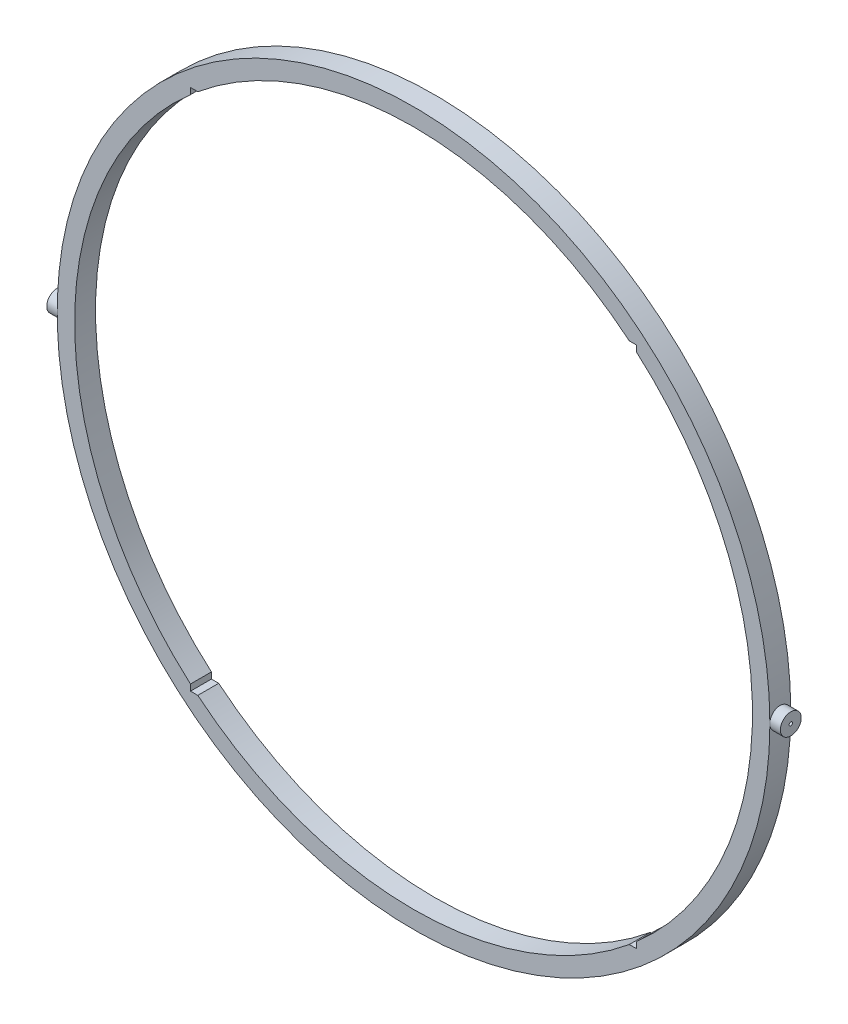
ISO-10303-21;
HEADER;
FILE_DESCRIPTION(('STEP AP214'),'2;1');
FILE_NAME('part.step','',(''),(''),'','','');
FILE_SCHEMA(('AUTOMOTIVE_DESIGN { 1 0 10303 214 1 1 1 1 }'));
ENDSEC;
DATA;
#1=APPLICATION_CONTEXT('core data for automotive mechanical design processes');
#2=APPLICATION_PROTOCOL_DEFINITION('international standard','automotive_design',2000,#1);
#3=PRODUCT_CONTEXT('',#1,'mechanical');
#4=PRODUCT('Part','Part','',(#3));
#5=PRODUCT_RELATED_PRODUCT_CATEGORY('part','',(#4));
#6=PRODUCT_DEFINITION_FORMATION('','',#4);
#7=PRODUCT_DEFINITION_CONTEXT('part definition',#1,'design');
#8=PRODUCT_DEFINITION('design','',#6,#7);
#9=PRODUCT_DEFINITION_SHAPE('','',#8);
#10=(LENGTH_UNIT() NAMED_UNIT(*) SI_UNIT(.MILLI.,.METRE.));
#11=(NAMED_UNIT(*) PLANE_ANGLE_UNIT() SI_UNIT($,.RADIAN.));
#12=(NAMED_UNIT(*) SI_UNIT($,.STERADIAN.) SOLID_ANGLE_UNIT());
#13=UNCERTAINTY_MEASURE_WITH_UNIT(LENGTH_MEASURE(1.E-05),#10,'distance_accuracy_value','');
#14=(GEOMETRIC_REPRESENTATION_CONTEXT(3) GLOBAL_UNCERTAINTY_ASSIGNED_CONTEXT((#13)) GLOBAL_UNIT_ASSIGNED_CONTEXT((#10,
#11,#12)) REPRESENTATION_CONTEXT('',''));
#15=CARTESIAN_POINT('',(0.,0.,0.));
#16=DIRECTION('',(0.,0.,1.));
#17=DIRECTION('',(1.,0.,0.));
#18=AXIS2_PLACEMENT_3D('',#15,#16,#17);
#19=CARTESIAN_POINT('',(105.24716621,0.,3.));
#20=DIRECTION('',(-1.,0.,0.));
#21=DIRECTION('',(0.,0.,1.));
#22=AXIS2_PLACEMENT_3D('',#19,#20,#21);
#23=CYLINDRICAL_SURFACE('',#22,3.);
#24=CARTESIAN_POINT('',(105.24716621,0.,3.));
#25=DIRECTION('',(-1.,0.,0.));
#26=DIRECTION('',(0.,0.,1.));
#27=AXIS2_PLACEMENT_3D('',#24,#25,#26);
#28=CIRCLE('',#27,3.);
#29=CARTESIAN_POINT('',(105.24716621,0.,6.));
#30=VERTEX_POINT('',#29);
#31=EDGE_CURVE('E11',#30,#30,#28,.T.);
#32=ORIENTED_EDGE('',*,*,#31,.T.);
#33=EDGE_LOOP('',(#32));
#34=FACE_BOUND('',#33,.T.);
#35=CARTESIAN_POINT('',(97.24716621,0.,3.));
#36=DIRECTION('',(-1.,0.,0.));
#37=DIRECTION('',(0.,0.,1.));
#38=AXIS2_PLACEMENT_3D('',#35,#36,#37);
#39=CIRCLE('',#38,3.);
#40=CARTESIAN_POINT('',(97.24716621,0.,6.));
#41=VERTEX_POINT('',#40);
#42=EDGE_CURVE('E49',#41,#41,#39,.T.);
#43=ORIENTED_EDGE('',*,*,#42,.F.);
#44=EDGE_LOOP('',(#43));
#45=FACE_BOUND('',#44,.T.);
#46=ADVANCED_FACE('F46',(#34,#45),#23,.T.);
#47=CARTESIAN_POINT('',(105.24716621,0.,3.));
#48=DIRECTION('',(-1.,0.,0.));
#49=DIRECTION('',(0.,0.,1.));
#50=AXIS2_PLACEMENT_3D('',#47,#48,#49);
#51=PLANE('',#50);
#52=CARTESIAN_POINT('',(105.24716621,0.,3.));
#53=DIRECTION('',(-1.,0.,0.));
#54=DIRECTION('',(0.,0.,1.));
#55=AXIS2_PLACEMENT_3D('',#52,#53,#54);
#56=CIRCLE('',#55,0.5);
#57=CARTESIAN_POINT('',(105.24716621,0.,3.5));
#58=VERTEX_POINT('',#57);
#59=EDGE_CURVE('E56',#58,#58,#56,.T.);
#60=ORIENTED_EDGE('',*,*,#59,.T.);
#61=EDGE_LOOP('',(#60));
#62=FACE_BOUND('',#61,.T.);
#63=ORIENTED_EDGE('',*,*,#31,.F.);
#64=EDGE_LOOP('',(#63));
#65=FACE_BOUND('',#64,.T.);
#66=ADVANCED_FACE('F64',(#62,#65),#51,.F.);
#67=CARTESIAN_POINT('',(97.24716621,0.,3.));
#68=DIRECTION('',(-1.,0.,0.));
#69=DIRECTION('',(0.,0.,1.));
#70=AXIS2_PLACEMENT_3D('',#67,#68,#69);
#71=PLANE('',#70);
#72=CARTESIAN_POINT('',(97.24716621,0.,3.));
#73=DIRECTION('',(-1.,0.,0.));
#74=DIRECTION('',(0.,0.,1.));
#75=AXIS2_PLACEMENT_3D('',#72,#73,#74);
#76=CIRCLE('',#75,0.5);
#77=CARTESIAN_POINT('',(97.24716621,0.,3.5));
#78=VERTEX_POINT('',#77);
#79=EDGE_CURVE('E58',#78,#78,#76,.T.);
#80=ORIENTED_EDGE('',*,*,#79,.F.);
#81=EDGE_LOOP('',(#80));
#82=FACE_BOUND('',#81,.T.);
#83=ORIENTED_EDGE('',*,*,#42,.T.);
#84=EDGE_LOOP('',(#83));
#85=FACE_BOUND('',#84,.T.);
#86=ADVANCED_FACE('F70',(#82,#85),#71,.T.);
#87=CARTESIAN_POINT('',(105.24716621,0.,3.));
#88=DIRECTION('',(-1.,0.,0.));
#89=DIRECTION('',(0.,0.,1.));
#90=AXIS2_PLACEMENT_3D('',#87,#88,#89);
#91=CYLINDRICAL_SURFACE('',#90,0.5);
#92=ORIENTED_EDGE('',*,*,#59,.F.);
#93=EDGE_LOOP('',(#92));
#94=FACE_BOUND('',#93,.T.);
#95=ORIENTED_EDGE('',*,*,#79,.T.);
#96=EDGE_LOOP('',(#95));
#97=FACE_BOUND('',#96,.T.);
#98=ADVANCED_FACE('F67',(#94,#97),#91,.F.);
#99=CLOSED_SHELL('',(#46,#66,#86,#98));
#100=MANIFOLD_SOLID_BREP('B2',#99);
#101=CARTESIAN_POINT('',(-105.24716621,0.,3.));
#102=DIRECTION('',(1.,0.,0.));
#103=DIRECTION('',(0.,0.,-1.));
#104=AXIS2_PLACEMENT_3D('',#101,#102,#103);
#105=CYLINDRICAL_SURFACE('',#104,3.);
#106=CARTESIAN_POINT('',(-105.24716621,0.,3.));
#107=DIRECTION('',(1.,0.,0.));
#108=DIRECTION('',(0.,0.,-1.));
#109=AXIS2_PLACEMENT_3D('',#106,#107,#108);
#110=CIRCLE('',#109,3.);
#111=CARTESIAN_POINT('',(-105.24716621,0.,0.));
#112=VERTEX_POINT('',#111);
#113=EDGE_CURVE('E45',#112,#112,#110,.T.);
#114=ORIENTED_EDGE('',*,*,#113,.T.);
#115=EDGE_LOOP('',(#114));
#116=FACE_BOUND('',#115,.T.);
#117=CARTESIAN_POINT('',(-97.24716621,0.,3.));
#118=DIRECTION('',(1.,0.,0.));
#119=DIRECTION('',(0.,0.,-1.));
#120=AXIS2_PLACEMENT_3D('',#117,#118,#119);
#121=CIRCLE('',#120,3.);
#122=CARTESIAN_POINT('',(-97.24716621,0.,0.));
#123=VERTEX_POINT('',#122);
#124=EDGE_CURVE('E120',#123,#123,#121,.T.);
#125=ORIENTED_EDGE('',*,*,#124,.F.);
#126=EDGE_LOOP('',(#125));
#127=FACE_BOUND('',#126,.T.);
#128=ADVANCED_FACE('F117',(#116,#127),#105,.T.);
#129=CARTESIAN_POINT('',(-105.24716621,0.,3.));
#130=DIRECTION('',(1.,0.,0.));
#131=DIRECTION('',(0.,0.,-1.));
#132=AXIS2_PLACEMENT_3D('',#129,#130,#131);
#133=PLANE('',#132);
#134=CARTESIAN_POINT('',(-105.24716621,0.,3.));
#135=DIRECTION('',(1.,0.,0.));
#136=DIRECTION('',(0.,0.,-1.));
#137=AXIS2_PLACEMENT_3D('',#134,#135,#136);
#138=CIRCLE('',#137,0.5);
#139=CARTESIAN_POINT('',(-105.24716621,0.,2.5));
#140=VERTEX_POINT('',#139);
#141=EDGE_CURVE('E127',#140,#140,#138,.T.);
#142=ORIENTED_EDGE('',*,*,#141,.T.);
#143=EDGE_LOOP('',(#142));
#144=FACE_BOUND('',#143,.T.);
#145=ORIENTED_EDGE('',*,*,#113,.F.);
#146=EDGE_LOOP('',(#145));
#147=FACE_BOUND('',#146,.T.);
#148=ADVANCED_FACE('F135',(#144,#147),#133,.F.);
#149=CARTESIAN_POINT('',(-97.24716621,0.,3.));
#150=DIRECTION('',(1.,0.,0.));
#151=DIRECTION('',(0.,0.,-1.));
#152=AXIS2_PLACEMENT_3D('',#149,#150,#151);
#153=PLANE('',#152);
#154=CARTESIAN_POINT('',(-97.24716621,0.,3.));
#155=DIRECTION('',(1.,0.,0.));
#156=DIRECTION('',(0.,0.,-1.));
#157=AXIS2_PLACEMENT_3D('',#154,#155,#156);
#158=CIRCLE('',#157,0.5);
#159=CARTESIAN_POINT('',(-97.24716621,0.,2.5));
#160=VERTEX_POINT('',#159);
#161=EDGE_CURVE('E129',#160,#160,#158,.T.);
#162=ORIENTED_EDGE('',*,*,#161,.F.);
#163=EDGE_LOOP('',(#162));
#164=FACE_BOUND('',#163,.T.);
#165=ORIENTED_EDGE('',*,*,#124,.T.);
#166=EDGE_LOOP('',(#165));
#167=FACE_BOUND('',#166,.T.);
#168=ADVANCED_FACE('F141',(#164,#167),#153,.T.);
#169=CARTESIAN_POINT('',(-105.24716621,0.,3.));
#170=DIRECTION('',(1.,0.,0.));
#171=DIRECTION('',(0.,0.,-1.));
#172=AXIS2_PLACEMENT_3D('',#169,#170,#171);
#173=CYLINDRICAL_SURFACE('',#172,0.5);
#174=ORIENTED_EDGE('',*,*,#141,.F.);
#175=EDGE_LOOP('',(#174));
#176=FACE_BOUND('',#175,.T.);
#177=ORIENTED_EDGE('',*,*,#161,.T.);
#178=EDGE_LOOP('',(#177));
#179=FACE_BOUND('',#178,.T.);
#180=ADVANCED_FACE('F138',(#176,#179),#173,.F.);
#181=CLOSED_SHELL('',(#128,#148,#168,#180));
#182=MANIFOLD_SOLID_BREP('B6',#181);
#183=CARTESIAN_POINT('',(0.,0.,6.));
#184=DIRECTION('',(0.,0.,-1.));
#185=DIRECTION('',(-1.,0.,0.));
#186=AXIS2_PLACEMENT_3D('',#183,#184,#185);
#187=CYLINDRICAL_SURFACE('',#186,97.24716621);
#188=DIRECTION('',(0.,0.,-1.));
#189=VECTOR('',#188,1.);
#190=CARTESIAN_POINT('',(-64.0000000000005,-73.2189274428088,6.));
#191=LINE('',#190,#189);
#192=CARTESIAN_POINT('',(-64.,-73.2189274428092,0.));
#193=VERTEX_POINT('',#192);
#194=CARTESIAN_POINT('',(-64.,-73.2189274428092,6.));
#195=VERTEX_POINT('',#194);
#196=EDGE_CURVE('E115',#193,#195,#191,.F.);
#197=ORIENTED_EDGE('',*,*,#196,.F.);
#198=CARTESIAN_POINT('',(0.,0.,0.));
#199=DIRECTION('',(0.,0.,1.));
#200=DIRECTION('',(1.,0.,0.));
#201=AXIS2_PLACEMENT_3D('',#198,#199,#200);
#202=CIRCLE('',#201,97.24716621);
#203=CARTESIAN_POINT('',(-64.,73.2189274428092,0.));
#204=VERTEX_POINT('',#203);
#205=EDGE_CURVE('E373',#204,#193,#202,.T.);
#206=ORIENTED_EDGE('',*,*,#205,.F.);
#207=DIRECTION('',(0.,0.,-1.));
#208=VECTOR('',#207,1.);
#209=CARTESIAN_POINT('',(-64.,73.2189274428092,6.));
#210=LINE('',#209,#208);
#211=CARTESIAN_POINT('',(-64.,73.2189274428092,6.));
#212=VERTEX_POINT('',#211);
#213=EDGE_CURVE('E351',#212,#204,#210,.T.);
#214=ORIENTED_EDGE('',*,*,#213,.F.);
#215=CARTESIAN_POINT('',(0.,0.,6.));
#216=DIRECTION('',(0.,0.,1.));
#217=DIRECTION('',(1.,0.,0.));
#218=AXIS2_PLACEMENT_3D('',#215,#216,#217);
#219=CIRCLE('',#218,97.24716621);
#220=EDGE_CURVE('E383',#212,#195,#219,.T.);
#221=ORIENTED_EDGE('',*,*,#220,.T.);
#222=EDGE_LOOP('',(#197,#206,#214,#221));
#223=FACE_BOUND('',#222,.T.);
#224=ADVANCED_FACE('F179',(#223),#187,.F.);
#225=DIRECTION('',(0.,0.,-1.));
#226=VECTOR('',#225,1.);
#227=CARTESIAN_POINT('',(64.0000000000011,-73.2189274428083,6.));
#228=LINE('',#227,#226);
#229=CARTESIAN_POINT('',(64.,-73.2189274428092,6.));
#230=VERTEX_POINT('',#229);
#231=CARTESIAN_POINT('',(64.,-73.2189274428092,0.));
#232=VERTEX_POINT('',#231);
#233=EDGE_CURVE('E358',#230,#232,#228,.T.);
#234=ORIENTED_EDGE('',*,*,#233,.F.);
#235=CARTESIAN_POINT('',(64.,73.2189274428092,6.));
#236=VERTEX_POINT('',#235);
#237=EDGE_CURVE('E336',#230,#236,#219,.T.);
#238=ORIENTED_EDGE('',*,*,#237,.T.);
#239=DIRECTION('',(0.,0.,-1.));
#240=VECTOR('',#239,1.);
#241=CARTESIAN_POINT('',(64.0000000000011,73.2189274428083,6.));
#242=LINE('',#241,#240);
#243=CARTESIAN_POINT('',(64.,73.2189274428092,0.));
#244=VERTEX_POINT('',#243);
#245=EDGE_CURVE('E284',#244,#236,#242,.F.);
#246=ORIENTED_EDGE('',*,*,#245,.F.);
#247=EDGE_CURVE('E335',#232,#244,#202,.T.);
#248=ORIENTED_EDGE('',*,*,#247,.F.);
#249=EDGE_LOOP('',(#234,#238,#246,#248));
#250=FACE_BOUND('',#249,.T.);
#251=ADVANCED_FACE('F398',(#250),#187,.F.);
#252=DIRECTION('',(0.,0.,-1.));
#253=VECTOR('',#252,1.);
#254=CARTESIAN_POINT('',(-61.9032417234782,-75.,6.));
#255=LINE('',#254,#253);
#256=CARTESIAN_POINT('',(-61.9032417234789,-74.9999999999994,6.));
#257=VERTEX_POINT('',#256);
#258=CARTESIAN_POINT('',(-61.9032417234781,-75.,0.));
#259=VERTEX_POINT('',#258);
#260=EDGE_CURVE('E187',#257,#259,#255,.T.);
#261=ORIENTED_EDGE('',*,*,#260,.F.);
#262=CARTESIAN_POINT('',(61.9032417234781,-75.,6.));
#263=VERTEX_POINT('',#262);
#264=EDGE_CURVE('E338',#257,#263,#219,.T.);
#265=ORIENTED_EDGE('',*,*,#264,.T.);
#266=DIRECTION('',(0.,0.,-1.));
#267=VECTOR('',#266,1.);
#268=CARTESIAN_POINT('',(61.9032417234785,-74.9999999999997,6.));
#269=LINE('',#268,#267);
#270=CARTESIAN_POINT('',(61.9032417234785,-74.9999999999997,0.));
#271=VERTEX_POINT('',#270);
#272=EDGE_CURVE('E356',#271,#263,#269,.F.);
#273=ORIENTED_EDGE('',*,*,#272,.F.);
#274=EDGE_CURVE('E342',#259,#271,#202,.T.);
#275=ORIENTED_EDGE('',*,*,#274,.F.);
#276=EDGE_LOOP('',(#261,#265,#273,#275));
#277=FACE_BOUND('',#276,.T.);
#278=ADVANCED_FACE('F372',(#277),#187,.F.);
#279=CARTESIAN_POINT('',(0.,0.,6.));
#280=DIRECTION('',(0.,0.,1.));
#281=DIRECTION('',(1.,0.,0.));
#282=AXIS2_PLACEMENT_3D('',#279,#280,#281);
#283=PLANE('',#282);
#284=DIRECTION('',(0.,-1.,0.));
#285=VECTOR('',#284,1.);
#286=CARTESIAN_POINT('',(-64.,-73.2189274428092,6.));
#287=LINE('',#286,#285);
#288=CARTESIAN_POINT('',(-64.,-75.,6.));
#289=VERTEX_POINT('',#288);
#290=EDGE_CURVE('E306',#195,#289,#287,.T.);
#291=ORIENTED_EDGE('',*,*,#290,.F.);
#292=ORIENTED_EDGE('',*,*,#220,.F.);
#293=DIRECTION('',(0.,-1.,0.));
#294=VECTOR('',#293,1.);
#295=CARTESIAN_POINT('',(-64.,73.2189274428092,6.));
#296=LINE('',#295,#294);
#297=CARTESIAN_POINT('',(-64.,75.,6.));
#298=VERTEX_POINT('',#297);
#299=EDGE_CURVE('E314',#298,#212,#296,.T.);
#300=ORIENTED_EDGE('',*,*,#299,.F.);
#301=DIRECTION('',(-1.,0.,0.));
#302=VECTOR('',#301,1.);
#303=CARTESIAN_POINT('',(-64.,75.,6.));
#304=LINE('',#303,#302);
#305=CARTESIAN_POINT('',(-61.9032417234781,75.,6.));
#306=VERTEX_POINT('',#305);
#307=EDGE_CURVE('E278',#306,#298,#304,.T.);
#308=ORIENTED_EDGE('',*,*,#307,.F.);
#309=CARTESIAN_POINT('',(61.9032417234785,74.9999999999997,6.));
#310=VERTEX_POINT('',#309);
#311=EDGE_CURVE('E296',#310,#306,#219,.T.);
#312=ORIENTED_EDGE('',*,*,#311,.F.);
#313=DIRECTION('',(-1.,0.,0.));
#314=VECTOR('',#313,1.);
#315=CARTESIAN_POINT('',(64.,75.,6.));
#316=LINE('',#315,#314);
#317=CARTESIAN_POINT('',(64.,75.,6.));
#318=VERTEX_POINT('',#317);
#319=EDGE_CURVE('E272',#318,#310,#316,.T.);
#320=ORIENTED_EDGE('',*,*,#319,.F.);
#321=DIRECTION('',(0.,1.,0.));
#322=VECTOR('',#321,1.);
#323=CARTESIAN_POINT('',(64.,73.2189274428092,6.));
#324=LINE('',#323,#322);
#325=EDGE_CURVE('E281',#236,#318,#324,.T.);
#326=ORIENTED_EDGE('',*,*,#325,.F.);
#327=ORIENTED_EDGE('',*,*,#237,.F.);
#328=DIRECTION('',(0.,1.,0.));
#329=VECTOR('',#328,1.);
#330=CARTESIAN_POINT('',(64.,-73.2189274428092,6.));
#331=LINE('',#330,#329);
#332=CARTESIAN_POINT('',(64.,-75.,6.));
#333=VERTEX_POINT('',#332);
#334=EDGE_CURVE('E299',#333,#230,#331,.T.);
#335=ORIENTED_EDGE('',*,*,#334,.F.);
#336=DIRECTION('',(1.,0.,0.));
#337=VECTOR('',#336,1.);
#338=CARTESIAN_POINT('',(64.,-75.,6.));
#339=LINE('',#338,#337);
#340=EDGE_CURVE('E301',#263,#333,#339,.T.);
#341=ORIENTED_EDGE('',*,*,#340,.F.);
#342=ORIENTED_EDGE('',*,*,#264,.F.);
#343=DIRECTION('',(1.,0.,0.));
#344=VECTOR('',#343,1.);
#345=CARTESIAN_POINT('',(-64.,-75.,6.));
#346=LINE('',#345,#344);
#347=EDGE_CURVE('E309',#289,#257,#346,.T.);
#348=ORIENTED_EDGE('',*,*,#347,.F.);
#349=EDGE_LOOP('',(#291,#292,#300,#308,#312,#320,#326,#327,#335,#341,#342,#348));
#350=FACE_BOUND('',#349,.T.);
#351=CARTESIAN_POINT('',(0.,0.,6.));
#352=DIRECTION('',(0.,0.,1.));
#353=DIRECTION('',(1.,0.,0.));
#354=AXIS2_PLACEMENT_3D('',#351,#352,#353);
#355=CIRCLE('',#354,102.24716621);
#356=CARTESIAN_POINT('',(102.24716621,0.,6.));
#357=VERTEX_POINT('',#356);
#358=EDGE_CURVE('E343',#357,#357,#355,.T.);
#359=ORIENTED_EDGE('',*,*,#358,.T.);
#360=EDGE_LOOP('',(#359));
#361=FACE_BOUND('',#360,.T.);
#362=ADVANCED_FACE('F292',(#350,#361),#283,.T.);
#363=CARTESIAN_POINT('',(0.,0.,0.));
#364=DIRECTION('',(0.,0.,1.));
#365=DIRECTION('',(1.,0.,0.));
#366=AXIS2_PLACEMENT_3D('',#363,#364,#365);
#367=PLANE('',#366);
#368=CARTESIAN_POINT('',(0.,0.,0.));
#369=DIRECTION('',(0.,0.,1.));
#370=DIRECTION('',(1.,0.,0.));
#371=AXIS2_PLACEMENT_3D('',#368,#369,#370);
#372=CIRCLE('',#371,102.24716621);
#373=CARTESIAN_POINT('',(102.24716621,0.,0.));
#374=VERTEX_POINT('',#373);
#375=EDGE_CURVE('E347',#374,#374,#372,.T.);
#376=ORIENTED_EDGE('',*,*,#375,.F.);
#377=EDGE_LOOP('',(#376));
#378=FACE_BOUND('',#377,.T.);
#379=ORIENTED_EDGE('',*,*,#205,.T.);
#380=DIRECTION('',(0.,-1.,0.));
#381=VECTOR('',#380,1.);
#382=CARTESIAN_POINT('',(-64.,0.,0.));
#383=LINE('',#382,#381);
#384=CARTESIAN_POINT('',(-64.,-75.,0.));
#385=VERTEX_POINT('',#384);
#386=EDGE_CURVE('E332',#193,#385,#383,.T.);
#387=ORIENTED_EDGE('',*,*,#386,.T.);
#388=DIRECTION('',(1.,0.,0.));
#389=VECTOR('',#388,1.);
#390=CARTESIAN_POINT('',(-9.92803125892652E-13,-75.0000000000008,0.));
#391=LINE('',#390,#389);
#392=EDGE_CURVE('E329',#385,#259,#391,.T.);
#393=ORIENTED_EDGE('',*,*,#392,.T.);
#394=ORIENTED_EDGE('',*,*,#274,.T.);
#395=DIRECTION('',(1.,0.,0.));
#396=VECTOR('',#395,1.);
#397=CARTESIAN_POINT('',(1.98560625178533E-12,-75.0000000000017,0.));
#398=LINE('',#397,#396);
#399=CARTESIAN_POINT('',(64.,-75.,0.));
#400=VERTEX_POINT('',#399);
#401=EDGE_CURVE('E194',#271,#400,#398,.T.);
#402=ORIENTED_EDGE('',*,*,#401,.T.);
#403=DIRECTION('',(0.,1.,0.));
#404=VECTOR('',#403,1.);
#405=CARTESIAN_POINT('',(64.,0.,0.));
#406=LINE('',#405,#404);
#407=EDGE_CURVE('E326',#400,#232,#406,.T.);
#408=ORIENTED_EDGE('',*,*,#407,.T.);
#409=ORIENTED_EDGE('',*,*,#247,.T.);
#410=DIRECTION('',(0.,1.,0.));
#411=VECTOR('',#410,1.);
#412=CARTESIAN_POINT('',(64.,0.,0.));
#413=LINE('',#412,#411);
#414=CARTESIAN_POINT('',(64.,75.,0.));
#415=VERTEX_POINT('',#414);
#416=EDGE_CURVE('E323',#244,#415,#413,.T.);
#417=ORIENTED_EDGE('',*,*,#416,.T.);
#418=DIRECTION('',(-1.,0.,0.));
#419=VECTOR('',#418,1.);
#420=CARTESIAN_POINT('',(1.98560625178533E-12,75.0000000000017,0.));
#421=LINE('',#420,#419);
#422=CARTESIAN_POINT('',(61.9032417234781,75.,0.));
#423=VERTEX_POINT('',#422);
#424=EDGE_CURVE('E275',#415,#423,#421,.T.);
#425=ORIENTED_EDGE('',*,*,#424,.T.);
#426=CARTESIAN_POINT('',(-61.9032417234782,75.,0.));
#427=VERTEX_POINT('',#426);
#428=EDGE_CURVE('E339',#423,#427,#202,.T.);
#429=ORIENTED_EDGE('',*,*,#428,.T.);
#430=DIRECTION('',(-1.,0.,0.));
#431=VECTOR('',#430,1.);
#432=CARTESIAN_POINT('',(-9.92803125892652E-13,75.0000000000008,0.));
#433=LINE('',#432,#431);
#434=CARTESIAN_POINT('',(-64.,75.,0.));
#435=VERTEX_POINT('',#434);
#436=EDGE_CURVE('E202',#427,#435,#433,.T.);
#437=ORIENTED_EDGE('',*,*,#436,.T.);
#438=DIRECTION('',(0.,-1.,0.));
#439=VECTOR('',#438,1.);
#440=CARTESIAN_POINT('',(-64.,0.,0.));
#441=LINE('',#440,#439);
#442=EDGE_CURVE('E319',#435,#204,#441,.T.);
#443=ORIENTED_EDGE('',*,*,#442,.T.);
#444=EDGE_LOOP('',(#379,#387,#393,#394,#402,#408,#409,#417,#425,#429,#437,#443));
#445=FACE_BOUND('',#444,.T.);
#446=ADVANCED_FACE('F371',(#378,#445),#367,.F.);
#447=CARTESIAN_POINT('',(0.,0.,6.));
#448=DIRECTION('',(0.,0.,-1.));
#449=DIRECTION('',(-1.,0.,0.));
#450=AXIS2_PLACEMENT_3D('',#447,#448,#449);
#451=CYLINDRICAL_SURFACE('',#450,102.24716621);
#452=ORIENTED_EDGE('',*,*,#358,.F.);
#453=EDGE_LOOP('',(#452));
#454=FACE_BOUND('',#453,.T.);
#455=ORIENTED_EDGE('',*,*,#375,.T.);
#456=EDGE_LOOP('',(#455));
#457=FACE_BOUND('',#456,.T.);
#458=ADVANCED_FACE('F181',(#454,#457),#451,.T.);
#459=DIRECTION('',(0.,0.,-1.));
#460=VECTOR('',#459,1.);
#461=CARTESIAN_POINT('',(61.9032417234781,75.,6.));
#462=LINE('',#461,#460);
#463=EDGE_CURVE('E353',#310,#423,#462,.T.);
#464=ORIENTED_EDGE('',*,*,#463,.F.);
#465=ORIENTED_EDGE('',*,*,#311,.T.);
#466=DIRECTION('',(0.,0.,-1.));
#467=VECTOR('',#466,1.);
#468=CARTESIAN_POINT('',(-61.9032417234782,75.,6.));
#469=LINE('',#468,#467);
#470=EDGE_CURVE('E346',#427,#306,#469,.F.);
#471=ORIENTED_EDGE('',*,*,#470,.F.);
#472=ORIENTED_EDGE('',*,*,#428,.F.);
#473=EDGE_LOOP('',(#464,#465,#471,#472));
#474=FACE_BOUND('',#473,.T.);
#475=ADVANCED_FACE('F378',(#474),#187,.F.);
#476=CARTESIAN_POINT('',(-64.,73.2189274428092,-4.));
#477=DIRECTION('',(-1.,0.,0.));
#478=DIRECTION('',(0.,0.,1.));
#479=AXIS2_PLACEMENT_3D('',#476,#477,#478);
#480=PLANE('',#479);
#481=DIRECTION('',(0.,0.,1.));
#482=VECTOR('',#481,1.);
#483=CARTESIAN_POINT('',(-64.,75.,-4.));
#484=LINE('',#483,#482);
#485=EDGE_CURVE('E316',#435,#298,#484,.T.);
#486=ORIENTED_EDGE('',*,*,#485,.T.);
#487=ORIENTED_EDGE('',*,*,#299,.T.);
#488=ORIENTED_EDGE('',*,*,#213,.T.);
#489=ORIENTED_EDGE('',*,*,#442,.F.);
#490=EDGE_LOOP('',(#486,#487,#488,#489));
#491=FACE_BOUND('',#490,.T.);
#492=ADVANCED_FACE('F386',(#491),#480,.F.);
#493=CARTESIAN_POINT('',(-64.,75.,-4.));
#494=DIRECTION('',(0.,1.,0.));
#495=DIRECTION('',(-1.,0.,0.));
#496=AXIS2_PLACEMENT_3D('',#493,#494,#495);
#497=PLANE('',#496);
#498=ORIENTED_EDGE('',*,*,#470,.T.);
#499=ORIENTED_EDGE('',*,*,#307,.T.);
#500=ORIENTED_EDGE('',*,*,#485,.F.);
#501=ORIENTED_EDGE('',*,*,#436,.F.);
#502=EDGE_LOOP('',(#498,#499,#500,#501));
#503=FACE_BOUND('',#502,.T.);
#504=ADVANCED_FACE('F379',(#503),#497,.F.);
#505=CARTESIAN_POINT('',(64.,73.2189274428092,-4.));
#506=DIRECTION('',(1.,0.,0.));
#507=DIRECTION('',(0.,0.,-1.));
#508=AXIS2_PLACEMENT_3D('',#505,#506,#507);
#509=PLANE('',#508);
#510=ORIENTED_EDGE('',*,*,#245,.T.);
#511=ORIENTED_EDGE('',*,*,#325,.T.);
#512=DIRECTION('',(0.,0.,1.));
#513=VECTOR('',#512,1.);
#514=CARTESIAN_POINT('',(64.,75.,-4.));
#515=LINE('',#514,#513);
#516=EDGE_CURVE('E268',#415,#318,#515,.T.);
#517=ORIENTED_EDGE('',*,*,#516,.F.);
#518=ORIENTED_EDGE('',*,*,#416,.F.);
#519=EDGE_LOOP('',(#510,#511,#517,#518));
#520=FACE_BOUND('',#519,.T.);
#521=ADVANCED_FACE('F282',(#520),#509,.F.);
#522=CARTESIAN_POINT('',(64.,75.,-4.));
#523=DIRECTION('',(0.,1.,0.));
#524=DIRECTION('',(-1.,0.,0.));
#525=AXIS2_PLACEMENT_3D('',#522,#523,#524);
#526=PLANE('',#525);
#527=ORIENTED_EDGE('',*,*,#516,.T.);
#528=ORIENTED_EDGE('',*,*,#319,.T.);
#529=ORIENTED_EDGE('',*,*,#463,.T.);
#530=ORIENTED_EDGE('',*,*,#424,.F.);
#531=EDGE_LOOP('',(#527,#528,#529,#530));
#532=FACE_BOUND('',#531,.T.);
#533=ADVANCED_FACE('F270',(#532),#526,.F.);
#534=CARTESIAN_POINT('',(64.,-73.2189274428092,-4.));
#535=DIRECTION('',(1.,0.,0.));
#536=DIRECTION('',(0.,0.,-1.));
#537=AXIS2_PLACEMENT_3D('',#534,#535,#536);
#538=PLANE('',#537);
#539=DIRECTION('',(0.,0.,1.));
#540=VECTOR('',#539,1.);
#541=CARTESIAN_POINT('',(64.,-75.,-4.));
#542=LINE('',#541,#540);
#543=EDGE_CURVE('E288',#400,#333,#542,.T.);
#544=ORIENTED_EDGE('',*,*,#543,.T.);
#545=ORIENTED_EDGE('',*,*,#334,.T.);
#546=ORIENTED_EDGE('',*,*,#233,.T.);
#547=ORIENTED_EDGE('',*,*,#407,.F.);
#548=EDGE_LOOP('',(#544,#545,#546,#547));
#549=FACE_BOUND('',#548,.T.);
#550=ADVANCED_FACE('F399',(#549),#538,.F.);
#551=CARTESIAN_POINT('',(64.,-75.,-4.));
#552=DIRECTION('',(0.,-1.,0.));
#553=DIRECTION('',(1.,0.,0.));
#554=AXIS2_PLACEMENT_3D('',#551,#552,#553);
#555=PLANE('',#554);
#556=ORIENTED_EDGE('',*,*,#272,.T.);
#557=ORIENTED_EDGE('',*,*,#340,.T.);
#558=ORIENTED_EDGE('',*,*,#543,.F.);
#559=ORIENTED_EDGE('',*,*,#401,.F.);
#560=EDGE_LOOP('',(#556,#557,#558,#559));
#561=FACE_BOUND('',#560,.T.);
#562=ADVANCED_FACE('F393',(#561),#555,.F.);
#563=CARTESIAN_POINT('',(-64.,-73.2189274428092,-4.));
#564=DIRECTION('',(-1.,0.,0.));
#565=DIRECTION('',(0.,0.,1.));
#566=AXIS2_PLACEMENT_3D('',#563,#564,#565);
#567=PLANE('',#566);
#568=ORIENTED_EDGE('',*,*,#196,.T.);
#569=ORIENTED_EDGE('',*,*,#290,.T.);
#570=DIRECTION('',(0.,0.,1.));
#571=VECTOR('',#570,1.);
#572=CARTESIAN_POINT('',(-64.,-75.,-4.));
#573=LINE('',#572,#571);
#574=EDGE_CURVE('E302',#385,#289,#573,.T.);
#575=ORIENTED_EDGE('',*,*,#574,.F.);
#576=ORIENTED_EDGE('',*,*,#386,.F.);
#577=EDGE_LOOP('',(#568,#569,#575,#576));
#578=FACE_BOUND('',#577,.T.);
#579=ADVANCED_FACE('F390',(#578),#567,.F.);
#580=CARTESIAN_POINT('',(-64.,-75.,-4.));
#581=DIRECTION('',(0.,-1.,0.));
#582=DIRECTION('',(1.,0.,0.));
#583=AXIS2_PLACEMENT_3D('',#580,#581,#582);
#584=PLANE('',#583);
#585=ORIENTED_EDGE('',*,*,#574,.T.);
#586=ORIENTED_EDGE('',*,*,#347,.T.);
#587=ORIENTED_EDGE('',*,*,#260,.T.);
#588=ORIENTED_EDGE('',*,*,#392,.F.);
#589=EDGE_LOOP('',(#585,#586,#587,#588));
#590=FACE_BOUND('',#589,.T.);
#591=ADVANCED_FACE('F361',(#590),#584,.F.);
#592=CLOSED_SHELL('',(#224,#251,#278,#362,#446,#458,#475,#492,#504,#521,#533,#550,#562,#579,#591));
#593=MANIFOLD_SOLID_BREP('B40',#592);
#594=ADVANCED_BREP_SHAPE_REPRESENTATION('',(#18,#100,#182,#593),#14);
#595=SHAPE_DEFINITION_REPRESENTATION(#9,#594);
ENDSEC;
END-ISO-10303-21;
